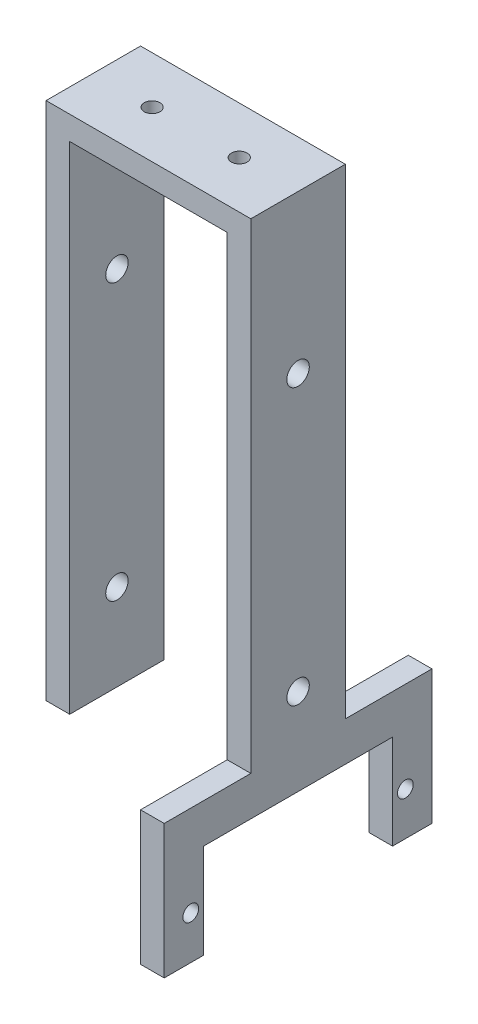
ISO-10303-21;
HEADER;
FILE_DESCRIPTION(('STEP AP214'),'2;1');
FILE_NAME('part.step','',(''),(''),'','','');
FILE_SCHEMA(('AUTOMOTIVE_DESIGN { 1 0 10303 214 1 1 1 1 }'));
ENDSEC;
DATA;
#1=APPLICATION_CONTEXT('core data for automotive mechanical design processes');
#2=APPLICATION_PROTOCOL_DEFINITION('international standard','automotive_design',2000,#1);
#3=PRODUCT_CONTEXT('',#1,'mechanical');
#4=PRODUCT('Part','Part','',(#3));
#5=PRODUCT_RELATED_PRODUCT_CATEGORY('part','',(#4));
#6=PRODUCT_DEFINITION_FORMATION('','',#4);
#7=PRODUCT_DEFINITION_CONTEXT('part definition',#1,'design');
#8=PRODUCT_DEFINITION('design','',#6,#7);
#9=PRODUCT_DEFINITION_SHAPE('','',#8);
#10=(LENGTH_UNIT() NAMED_UNIT(*) SI_UNIT(.MILLI.,.METRE.));
#11=(NAMED_UNIT(*) PLANE_ANGLE_UNIT() SI_UNIT($,.RADIAN.));
#12=(NAMED_UNIT(*) SI_UNIT($,.STERADIAN.) SOLID_ANGLE_UNIT());
#13=UNCERTAINTY_MEASURE_WITH_UNIT(LENGTH_MEASURE(1.E-05),#10,'distance_accuracy_value','');
#14=(GEOMETRIC_REPRESENTATION_CONTEXT(3) GLOBAL_UNCERTAINTY_ASSIGNED_CONTEXT((#13)) GLOBAL_UNIT_ASSIGNED_CONTEXT((#10,
#11,#12)) REPRESENTATION_CONTEXT('',''));
#15=CARTESIAN_POINT('',(0.,0.,0.));
#16=DIRECTION('',(0.,0.,1.));
#17=DIRECTION('',(1.,0.,0.));
#18=AXIS2_PLACEMENT_3D('',#15,#16,#17);
#19=CARTESIAN_POINT('',(-13.,3.,-6.));
#20=DIRECTION('',(0.,0.,1.));
#21=DIRECTION('',(1.,0.,0.));
#22=AXIS2_PLACEMENT_3D('',#19,#20,#21);
#23=PLANE('',#22);
#24=DIRECTION('',(0.,1.,0.));
#25=VECTOR('',#24,1.);
#26=CARTESIAN_POINT('',(-10.,-75.,-6.));
#27=LINE('',#26,#25);
#28=CARTESIAN_POINT('',(-10.,-63.,-6.));
#29=VERTEX_POINT('',#28);
#30=CARTESIAN_POINT('',(-10.,0.,-6.));
#31=VERTEX_POINT('',#30);
#32=EDGE_CURVE('E173',#29,#31,#27,.T.);
#33=ORIENTED_EDGE('',*,*,#32,.F.);
#34=DIRECTION('',(1.,0.,0.));
#35=VECTOR('',#34,1.);
#36=CARTESIAN_POINT('',(-13.,-63.,-6.));
#37=LINE('',#36,#35);
#38=CARTESIAN_POINT('',(-13.,-63.,-6.));
#39=VERTEX_POINT('',#38);
#40=EDGE_CURVE('E62',#39,#29,#37,.T.);
#41=ORIENTED_EDGE('',*,*,#40,.F.);
#42=DIRECTION('',(0.,-1.,0.));
#43=VECTOR('',#42,1.);
#44=CARTESIAN_POINT('',(-13.,3.,-6.));
#45=LINE('',#44,#43);
#46=CARTESIAN_POINT('',(-13.,3.,-6.));
#47=VERTEX_POINT('',#46);
#48=EDGE_CURVE('E54',#47,#39,#45,.T.);
#49=ORIENTED_EDGE('',*,*,#48,.F.);
#50=DIRECTION('',(-1.,0.,0.));
#51=VECTOR('',#50,1.);
#52=CARTESIAN_POINT('',(-13.,3.,-6.));
#53=LINE('',#52,#51);
#54=CARTESIAN_POINT('',(13.,3.,-6.));
#55=VERTEX_POINT('',#54);
#56=EDGE_CURVE('E232',#55,#47,#53,.T.);
#57=ORIENTED_EDGE('',*,*,#56,.F.);
#58=DIRECTION('',(0.,-1.,0.));
#59=VECTOR('',#58,1.);
#60=CARTESIAN_POINT('',(13.,3.,-6.));
#61=LINE('',#60,#59);
#62=CARTESIAN_POINT('',(13.,-58.,-6.));
#63=VERTEX_POINT('',#62);
#64=EDGE_CURVE('E13',#55,#63,#61,.T.);
#65=ORIENTED_EDGE('',*,*,#64,.T.);
#66=DIRECTION('',(1.,0.,0.));
#67=VECTOR('',#66,1.);
#68=CARTESIAN_POINT('',(9.99999999999999,-58.,-6.));
#69=LINE('',#68,#67);
#70=CARTESIAN_POINT('',(9.99999999999999,-58.,-6.));
#71=VERTEX_POINT('',#70);
#72=EDGE_CURVE('E328',#71,#63,#69,.T.);
#73=ORIENTED_EDGE('',*,*,#72,.F.);
#74=DIRECTION('',(0.,1.,0.));
#75=VECTOR('',#74,1.);
#76=CARTESIAN_POINT('',(10.,-75.,-6.));
#77=LINE('',#76,#75);
#78=CARTESIAN_POINT('',(10.,0.,-6.));
#79=VERTEX_POINT('',#78);
#80=EDGE_CURVE('E206',#71,#79,#77,.T.);
#81=ORIENTED_EDGE('',*,*,#80,.T.);
#82=DIRECTION('',(-1.,0.,0.));
#83=VECTOR('',#82,1.);
#84=CARTESIAN_POINT('',(-13.,0.,-6.));
#85=LINE('',#84,#83);
#86=EDGE_CURVE('E228',#79,#31,#85,.T.);
#87=ORIENTED_EDGE('',*,*,#86,.T.);
#88=EDGE_LOOP('',(#33,#41,#49,#57,#65,#73,#81,#87));
#89=FACE_BOUND('',#88,.T.);
#90=ADVANCED_FACE('F45',(#89),#23,.F.);
#91=CARTESIAN_POINT('',(13.,3.,6.));
#92=DIRECTION('',(-1.,0.,0.));
#93=DIRECTION('',(0.,0.,1.));
#94=AXIS2_PLACEMENT_3D('',#91,#92,#93);
#95=PLANE('',#94);
#96=CARTESIAN_POINT('',(13.,-69.5262873670848,-13.625));
#97=DIRECTION('',(-1.,0.,0.));
#98=DIRECTION('',(0.,0.,1.));
#99=AXIS2_PLACEMENT_3D('',#96,#97,#98);
#100=CIRCLE('',#99,1.);
#101=CARTESIAN_POINT('',(13.,-69.5262873670848,-12.625));
#102=VERTEX_POINT('',#101);
#103=EDGE_CURVE('E344',#102,#102,#100,.T.);
#104=ORIENTED_EDGE('',*,*,#103,.T.);
#105=EDGE_LOOP('',(#104));
#106=FACE_BOUND('',#105,.T.);
#107=CARTESIAN_POINT('',(13.,-69.5262873670848,13.625));
#108=DIRECTION('',(1.,0.,0.));
#109=DIRECTION('',(0.,0.,-1.));
#110=AXIS2_PLACEMENT_3D('',#107,#108,#109);
#111=CIRCLE('',#110,1.);
#112=CARTESIAN_POINT('',(13.,-69.5262873670848,12.625));
#113=VERTEX_POINT('',#112);
#114=EDGE_CURVE('E352',#113,#113,#111,.T.);
#115=ORIENTED_EDGE('',*,*,#114,.F.);
#116=EDGE_LOOP('',(#115));
#117=FACE_BOUND('',#116,.T.);
#118=CARTESIAN_POINT('',(13.,-52.,0.));
#119=DIRECTION('',(-1.,0.,0.));
#120=DIRECTION('',(0.,0.,1.));
#121=AXIS2_PLACEMENT_3D('',#118,#119,#120);
#122=CIRCLE('',#121,1.425);
#123=CARTESIAN_POINT('',(13.,-52.,1.425));
#124=VERTEX_POINT('',#123);
#125=EDGE_CURVE('E192',#124,#124,#122,.T.);
#126=ORIENTED_EDGE('',*,*,#125,.T.);
#127=EDGE_LOOP('',(#126));
#128=FACE_BOUND('',#127,.T.);
#129=CARTESIAN_POINT('',(13.,-17.,0.));
#130=DIRECTION('',(-1.,0.,0.));
#131=DIRECTION('',(0.,0.,1.));
#132=AXIS2_PLACEMENT_3D('',#129,#130,#131);
#133=CIRCLE('',#132,1.425);
#134=CARTESIAN_POINT('',(13.,-17.,1.425));
#135=VERTEX_POINT('',#134);
#136=EDGE_CURVE('E189',#135,#135,#133,.T.);
#137=ORIENTED_EDGE('',*,*,#136,.T.);
#138=EDGE_LOOP('',(#137));
#139=FACE_BOUND('',#138,.T.);
#140=DIRECTION('',(0.,0.,-1.));
#141=VECTOR('',#140,1.);
#142=CARTESIAN_POINT('',(13.,-63.,6.));
#143=LINE('',#142,#141);
#144=CARTESIAN_POINT('',(13.,-63.,12.));
#145=VERTEX_POINT('',#144);
#146=CARTESIAN_POINT('',(13.,-63.,-12.));
#147=VERTEX_POINT('',#146);
#148=EDGE_CURVE('E388',#145,#147,#143,.T.);
#149=ORIENTED_EDGE('',*,*,#148,.T.);
#150=DIRECTION('',(0.,1.,0.));
#151=VECTOR('',#150,1.);
#152=CARTESIAN_POINT('',(13.,-63.,-12.));
#153=LINE('',#152,#151);
#154=CARTESIAN_POINT('',(13.,-75.,-12.));
#155=VERTEX_POINT('',#154);
#156=EDGE_CURVE('E357',#155,#147,#153,.T.);
#157=ORIENTED_EDGE('',*,*,#156,.F.);
#158=DIRECTION('',(0.,0.,1.));
#159=VECTOR('',#158,1.);
#160=CARTESIAN_POINT('',(13.,-75.,-17.));
#161=LINE('',#160,#159);
#162=CARTESIAN_POINT('',(13.,-75.,-17.));
#163=VERTEX_POINT('',#162);
#164=EDGE_CURVE('E370',#163,#155,#161,.T.);
#165=ORIENTED_EDGE('',*,*,#164,.F.);
#166=DIRECTION('',(0.,-1.,0.));
#167=VECTOR('',#166,1.);
#168=CARTESIAN_POINT('',(13.,-58.,-17.));
#169=LINE('',#168,#167);
#170=CARTESIAN_POINT('',(13.,-58.,-17.));
#171=VERTEX_POINT('',#170);
#172=EDGE_CURVE('E372',#171,#163,#169,.T.);
#173=ORIENTED_EDGE('',*,*,#172,.F.);
#174=DIRECTION('',(0.,0.,-1.));
#175=VECTOR('',#174,1.);
#176=CARTESIAN_POINT('',(13.,-58.,-6.));
#177=LINE('',#176,#175);
#178=EDGE_CURVE('E325',#63,#171,#177,.T.);
#179=ORIENTED_EDGE('',*,*,#178,.F.);
#180=ORIENTED_EDGE('',*,*,#64,.F.);
#181=DIRECTION('',(0.,0.,-1.));
#182=VECTOR('',#181,1.);
#183=CARTESIAN_POINT('',(13.,3.,6.));
#184=LINE('',#183,#182);
#185=CARTESIAN_POINT('',(13.,3.,6.));
#186=VERTEX_POINT('',#185);
#187=EDGE_CURVE('E229',#186,#55,#184,.T.);
#188=ORIENTED_EDGE('',*,*,#187,.F.);
#189=DIRECTION('',(0.,-1.,0.));
#190=VECTOR('',#189,1.);
#191=CARTESIAN_POINT('',(13.,3.,6.));
#192=LINE('',#191,#190);
#193=CARTESIAN_POINT('',(13.,-58.,6.));
#194=VERTEX_POINT('',#193);
#195=EDGE_CURVE('E179',#186,#194,#192,.T.);
#196=ORIENTED_EDGE('',*,*,#195,.T.);
#197=DIRECTION('',(0.,0.,1.));
#198=VECTOR('',#197,1.);
#199=CARTESIAN_POINT('',(13.,-58.,6.));
#200=LINE('',#199,#198);
#201=CARTESIAN_POINT('',(13.,-58.,17.));
#202=VERTEX_POINT('',#201);
#203=EDGE_CURVE('E70',#194,#202,#200,.T.);
#204=ORIENTED_EDGE('',*,*,#203,.T.);
#205=DIRECTION('',(0.,-1.,0.));
#206=VECTOR('',#205,1.);
#207=CARTESIAN_POINT('',(13.,-63.,17.));
#208=LINE('',#207,#206);
#209=CARTESIAN_POINT('',(13.,-75.,17.));
#210=VERTEX_POINT('',#209);
#211=EDGE_CURVE('E396',#202,#210,#208,.T.);
#212=ORIENTED_EDGE('',*,*,#211,.T.);
#213=DIRECTION('',(0.,0.,-1.));
#214=VECTOR('',#213,1.);
#215=CARTESIAN_POINT('',(13.,-75.,17.));
#216=LINE('',#215,#214);
#217=CARTESIAN_POINT('',(13.,-75.,12.));
#218=VERTEX_POINT('',#217);
#219=EDGE_CURVE('E398',#210,#218,#216,.T.);
#220=ORIENTED_EDGE('',*,*,#219,.T.);
#221=DIRECTION('',(0.,1.,0.));
#222=VECTOR('',#221,1.);
#223=CARTESIAN_POINT('',(13.,-63.,12.));
#224=LINE('',#223,#222);
#225=EDGE_CURVE('E401',#218,#145,#224,.T.);
#226=ORIENTED_EDGE('',*,*,#225,.T.);
#227=EDGE_LOOP('',(#149,#157,#165,#173,#179,#180,#188,#196,#204,#212,#220,#226));
#228=FACE_BOUND('',#227,.T.);
#229=ADVANCED_FACE('F47',(#106,#117,#128,#139,#228),#95,.F.);
#230=CARTESIAN_POINT('',(-13.,3.,6.));
#231=DIRECTION('',(1.,0.,0.));
#232=DIRECTION('',(0.,0.,-1.));
#233=AXIS2_PLACEMENT_3D('',#230,#231,#232);
#234=PLANE('',#233);
#235=CARTESIAN_POINT('',(-13.,-52.,0.));
#236=DIRECTION('',(-1.,0.,0.));
#237=DIRECTION('',(0.,0.,1.));
#238=AXIS2_PLACEMENT_3D('',#235,#236,#237);
#239=CIRCLE('',#238,1.425);
#240=CARTESIAN_POINT('',(-13.,-52.,1.425));
#241=VERTEX_POINT('',#240);
#242=EDGE_CURVE('E262',#241,#241,#239,.T.);
#243=ORIENTED_EDGE('',*,*,#242,.F.);
#244=EDGE_LOOP('',(#243));
#245=FACE_BOUND('',#244,.T.);
#246=CARTESIAN_POINT('',(-13.,-17.,0.));
#247=DIRECTION('',(-1.,0.,0.));
#248=DIRECTION('',(0.,0.,1.));
#249=AXIS2_PLACEMENT_3D('',#246,#247,#248);
#250=CIRCLE('',#249,1.425);
#251=CARTESIAN_POINT('',(-13.,-17.,1.425));
#252=VERTEX_POINT('',#251);
#253=EDGE_CURVE('E185',#252,#252,#250,.T.);
#254=ORIENTED_EDGE('',*,*,#253,.F.);
#255=EDGE_LOOP('',(#254));
#256=FACE_BOUND('',#255,.T.);
#257=ORIENTED_EDGE('',*,*,#48,.T.);
#258=DIRECTION('',(0.,0.,1.));
#259=VECTOR('',#258,1.);
#260=CARTESIAN_POINT('',(-13.,-63.,-6.));
#261=LINE('',#260,#259);
#262=CARTESIAN_POINT('',(-13.,-63.,6.));
#263=VERTEX_POINT('',#262);
#264=EDGE_CURVE('E159',#39,#263,#261,.T.);
#265=ORIENTED_EDGE('',*,*,#264,.T.);
#266=DIRECTION('',(0.,-1.,0.));
#267=VECTOR('',#266,1.);
#268=CARTESIAN_POINT('',(-13.,3.,6.));
#269=LINE('',#268,#267);
#270=CARTESIAN_POINT('',(-13.,3.,6.));
#271=VERTEX_POINT('',#270);
#272=EDGE_CURVE('E177',#271,#263,#269,.T.);
#273=ORIENTED_EDGE('',*,*,#272,.F.);
#274=DIRECTION('',(0.,0.,1.));
#275=VECTOR('',#274,1.);
#276=CARTESIAN_POINT('',(-13.,3.,6.));
#277=LINE('',#276,#275);
#278=EDGE_CURVE('E176',#47,#271,#277,.T.);
#279=ORIENTED_EDGE('',*,*,#278,.F.);
#280=EDGE_LOOP('',(#257,#265,#273,#279));
#281=FACE_BOUND('',#280,.T.);
#282=ADVANCED_FACE('F175',(#245,#256,#281),#234,.F.);
#283=CARTESIAN_POINT('',(-13.,3.,6.));
#284=DIRECTION('',(0.,0.,-1.));
#285=DIRECTION('',(-1.,0.,0.));
#286=AXIS2_PLACEMENT_3D('',#283,#284,#285);
#287=PLANE('',#286);
#288=ORIENTED_EDGE('',*,*,#272,.T.);
#289=DIRECTION('',(1.,0.,0.));
#290=VECTOR('',#289,1.);
#291=CARTESIAN_POINT('',(-13.,-63.,6.));
#292=LINE('',#291,#290);
#293=CARTESIAN_POINT('',(-10.,-63.,6.));
#294=VERTEX_POINT('',#293);
#295=EDGE_CURVE('E162',#263,#294,#292,.T.);
#296=ORIENTED_EDGE('',*,*,#295,.T.);
#297=DIRECTION('',(0.,1.,0.));
#298=VECTOR('',#297,1.);
#299=CARTESIAN_POINT('',(-10.,-75.,6.));
#300=LINE('',#299,#298);
#301=CARTESIAN_POINT('',(-10.,0.,6.));
#302=VERTEX_POINT('',#301);
#303=EDGE_CURVE('E213',#294,#302,#300,.T.);
#304=ORIENTED_EDGE('',*,*,#303,.T.);
#305=DIRECTION('',(1.,0.,0.));
#306=VECTOR('',#305,1.);
#307=CARTESIAN_POINT('',(-13.,0.,6.));
#308=LINE('',#307,#306);
#309=CARTESIAN_POINT('',(10.,0.,6.));
#310=VERTEX_POINT('',#309);
#311=EDGE_CURVE('E233',#302,#310,#308,.T.);
#312=ORIENTED_EDGE('',*,*,#311,.T.);
#313=DIRECTION('',(0.,1.,0.));
#314=VECTOR('',#313,1.);
#315=CARTESIAN_POINT('',(10.,-75.,6.));
#316=LINE('',#315,#314);
#317=CARTESIAN_POINT('',(9.99999999999999,-58.,6.));
#318=VERTEX_POINT('',#317);
#319=EDGE_CURVE('E208',#318,#310,#316,.T.);
#320=ORIENTED_EDGE('',*,*,#319,.F.);
#321=DIRECTION('',(1.,0.,0.));
#322=VECTOR('',#321,1.);
#323=CARTESIAN_POINT('',(9.99999999999999,-58.,6.));
#324=LINE('',#323,#322);
#325=EDGE_CURVE('E250',#318,#194,#324,.T.);
#326=ORIENTED_EDGE('',*,*,#325,.T.);
#327=ORIENTED_EDGE('',*,*,#195,.F.);
#328=DIRECTION('',(1.,0.,0.));
#329=VECTOR('',#328,1.);
#330=CARTESIAN_POINT('',(-13.,3.,6.));
#331=LINE('',#330,#329);
#332=EDGE_CURVE('E236',#271,#186,#331,.T.);
#333=ORIENTED_EDGE('',*,*,#332,.F.);
#334=EDGE_LOOP('',(#288,#296,#304,#312,#320,#326,#327,#333));
#335=FACE_BOUND('',#334,.T.);
#336=ADVANCED_FACE('F248',(#335),#287,.F.);
#337=CARTESIAN_POINT('',(0.,3.,0.));
#338=DIRECTION('',(0.,-1.,0.));
#339=DIRECTION('',(0.,0.,-1.));
#340=AXIS2_PLACEMENT_3D('',#337,#338,#339);
#341=PLANE('',#340);
#342=CARTESIAN_POINT('',(-5.535,3.,0.));
#343=DIRECTION('',(0.,-1.,0.));
#344=DIRECTION('',(0.,0.,-1.));
#345=AXIS2_PLACEMENT_3D('',#342,#343,#344);
#346=CIRCLE('',#345,1.);
#347=CARTESIAN_POINT('',(-5.535,3.,-1.));
#348=VERTEX_POINT('',#347);
#349=EDGE_CURVE('E225',#348,#348,#346,.T.);
#350=ORIENTED_EDGE('',*,*,#349,.T.);
#351=EDGE_LOOP('',(#350));
#352=FACE_BOUND('',#351,.T.);
#353=CARTESIAN_POINT('',(5.535,3.,0.));
#354=DIRECTION('',(0.,-1.,0.));
#355=DIRECTION('',(0.,0.,-1.));
#356=AXIS2_PLACEMENT_3D('',#353,#354,#355);
#357=CIRCLE('',#356,1.);
#358=CARTESIAN_POINT('',(5.535,3.,-0.999999999999999));
#359=VERTEX_POINT('',#358);
#360=EDGE_CURVE('E220',#359,#359,#357,.T.);
#361=ORIENTED_EDGE('',*,*,#360,.T.);
#362=EDGE_LOOP('',(#361));
#363=FACE_BOUND('',#362,.T.);
#364=ORIENTED_EDGE('',*,*,#187,.T.);
#365=ORIENTED_EDGE('',*,*,#56,.T.);
#366=ORIENTED_EDGE('',*,*,#278,.T.);
#367=ORIENTED_EDGE('',*,*,#332,.T.);
#368=EDGE_LOOP('',(#364,#365,#366,#367));
#369=FACE_BOUND('',#368,.T.);
#370=ADVANCED_FACE('F302',(#352,#363,#369),#341,.F.);
#371=CARTESIAN_POINT('',(0.,0.,0.));
#372=DIRECTION('',(0.,-1.,0.));
#373=DIRECTION('',(0.,0.,-1.));
#374=AXIS2_PLACEMENT_3D('',#371,#372,#373);
#375=PLANE('',#374);
#376=DIRECTION('',(0.,0.,1.));
#377=VECTOR('',#376,1.);
#378=CARTESIAN_POINT('',(10.,0.,6.));
#379=LINE('',#378,#377);
#380=EDGE_CURVE('E203',#79,#310,#379,.T.);
#381=ORIENTED_EDGE('',*,*,#380,.T.);
#382=ORIENTED_EDGE('',*,*,#311,.F.);
#383=DIRECTION('',(0.,0.,1.));
#384=VECTOR('',#383,1.);
#385=CARTESIAN_POINT('',(-10.,0.,6.));
#386=LINE('',#385,#384);
#387=EDGE_CURVE('E210',#31,#302,#386,.T.);
#388=ORIENTED_EDGE('',*,*,#387,.F.);
#389=ORIENTED_EDGE('',*,*,#86,.F.);
#390=EDGE_LOOP('',(#381,#382,#388,#389));
#391=FACE_BOUND('',#390,.T.);
#392=CARTESIAN_POINT('',(-5.535,0.,0.));
#393=DIRECTION('',(0.,-1.,0.));
#394=DIRECTION('',(0.,0.,-1.));
#395=AXIS2_PLACEMENT_3D('',#392,#393,#394);
#396=CIRCLE('',#395,1.);
#397=CARTESIAN_POINT('',(-5.535,0.,-1.));
#398=VERTEX_POINT('',#397);
#399=EDGE_CURVE('E217',#398,#398,#396,.T.);
#400=ORIENTED_EDGE('',*,*,#399,.F.);
#401=EDGE_LOOP('',(#400));
#402=FACE_BOUND('',#401,.T.);
#403=CARTESIAN_POINT('',(5.535,0.,0.));
#404=DIRECTION('',(0.,-1.,0.));
#405=DIRECTION('',(0.,0.,-1.));
#406=AXIS2_PLACEMENT_3D('',#403,#404,#405);
#407=CIRCLE('',#406,1.);
#408=CARTESIAN_POINT('',(5.535,0.,-0.999999999999999));
#409=VERTEX_POINT('',#408);
#410=EDGE_CURVE('E216',#409,#409,#407,.T.);
#411=ORIENTED_EDGE('',*,*,#410,.F.);
#412=EDGE_LOOP('',(#411));
#413=FACE_BOUND('',#412,.T.);
#414=ADVANCED_FACE('F303',(#391,#402,#413),#375,.T.);
#415=CARTESIAN_POINT('',(5.535,10.,0.));
#416=DIRECTION('',(0.,-1.,0.));
#417=DIRECTION('',(0.,0.,-1.));
#418=AXIS2_PLACEMENT_3D('',#415,#416,#417);
#419=CYLINDRICAL_SURFACE('',#418,1.);
#420=ORIENTED_EDGE('',*,*,#410,.T.);
#421=EDGE_LOOP('',(#420));
#422=FACE_BOUND('',#421,.T.);
#423=ORIENTED_EDGE('',*,*,#360,.F.);
#424=EDGE_LOOP('',(#423));
#425=FACE_BOUND('',#424,.T.);
#426=ADVANCED_FACE('F306',(#422,#425),#419,.F.);
#427=CARTESIAN_POINT('',(-5.535,10.,0.));
#428=DIRECTION('',(0.,-1.,0.));
#429=DIRECTION('',(0.,0.,-1.));
#430=AXIS2_PLACEMENT_3D('',#427,#428,#429);
#431=CYLINDRICAL_SURFACE('',#430,1.);
#432=ORIENTED_EDGE('',*,*,#399,.T.);
#433=EDGE_LOOP('',(#432));
#434=FACE_BOUND('',#433,.T.);
#435=ORIENTED_EDGE('',*,*,#349,.F.);
#436=EDGE_LOOP('',(#435));
#437=FACE_BOUND('',#436,.T.);
#438=ADVANCED_FACE('F287',(#434,#437),#431,.F.);
#439=CARTESIAN_POINT('',(-10.,-75.,6.));
#440=DIRECTION('',(-1.,0.,0.));
#441=DIRECTION('',(0.,0.,1.));
#442=AXIS2_PLACEMENT_3D('',#439,#440,#441);
#443=PLANE('',#442);
#444=CARTESIAN_POINT('',(-10.,-52.,0.));
#445=DIRECTION('',(-1.,0.,0.));
#446=DIRECTION('',(0.,0.,1.));
#447=AXIS2_PLACEMENT_3D('',#444,#445,#446);
#448=CIRCLE('',#447,1.425);
#449=CARTESIAN_POINT('',(-10.,-52.,1.425));
#450=VERTEX_POINT('',#449);
#451=EDGE_CURVE('E197',#450,#450,#448,.T.);
#452=ORIENTED_EDGE('',*,*,#451,.T.);
#453=EDGE_LOOP('',(#452));
#454=FACE_BOUND('',#453,.T.);
#455=CARTESIAN_POINT('',(-10.,-17.,0.));
#456=DIRECTION('',(-1.,0.,0.));
#457=DIRECTION('',(0.,0.,1.));
#458=AXIS2_PLACEMENT_3D('',#455,#456,#457);
#459=CIRCLE('',#458,1.425);
#460=CARTESIAN_POINT('',(-10.,-17.,1.425));
#461=VERTEX_POINT('',#460);
#462=EDGE_CURVE('E184',#461,#461,#459,.T.);
#463=ORIENTED_EDGE('',*,*,#462,.T.);
#464=EDGE_LOOP('',(#463));
#465=FACE_BOUND('',#464,.T.);
#466=ORIENTED_EDGE('',*,*,#303,.F.);
#467=DIRECTION('',(0.,0.,-1.));
#468=VECTOR('',#467,1.);
#469=CARTESIAN_POINT('',(-10.,-63.,6.));
#470=LINE('',#469,#468);
#471=EDGE_CURVE('E343',#294,#29,#470,.T.);
#472=ORIENTED_EDGE('',*,*,#471,.T.);
#473=ORIENTED_EDGE('',*,*,#32,.T.);
#474=ORIENTED_EDGE('',*,*,#387,.T.);
#475=EDGE_LOOP('',(#466,#472,#473,#474));
#476=FACE_BOUND('',#475,.T.);
#477=ADVANCED_FACE('F278',(#454,#465,#476),#443,.F.);
#478=CARTESIAN_POINT('',(10.,-75.,6.));
#479=DIRECTION('',(-1.,0.,0.));
#480=DIRECTION('',(0.,0.,1.));
#481=AXIS2_PLACEMENT_3D('',#478,#479,#480);
#482=PLANE('',#481);
#483=DIRECTION('',(0.,1.,0.));
#484=VECTOR('',#483,1.);
#485=CARTESIAN_POINT('',(9.99999999999999,-63.,-12.));
#486=LINE('',#485,#484);
#487=CARTESIAN_POINT('',(9.99999999999999,-75.,-12.));
#488=VERTEX_POINT('',#487);
#489=CARTESIAN_POINT('',(9.99999999999999,-63.,-12.));
#490=VERTEX_POINT('',#489);
#491=EDGE_CURVE('E360',#488,#490,#486,.T.);
#492=ORIENTED_EDGE('',*,*,#491,.T.);
#493=DIRECTION('',(0.,0.,-1.));
#494=VECTOR('',#493,1.);
#495=CARTESIAN_POINT('',(9.99999999999999,-63.,6.));
#496=LINE('',#495,#494);
#497=CARTESIAN_POINT('',(9.99999999999999,-63.,12.));
#498=VERTEX_POINT('',#497);
#499=EDGE_CURVE('E254',#498,#490,#496,.T.);
#500=ORIENTED_EDGE('',*,*,#499,.F.);
#501=DIRECTION('',(0.,1.,0.));
#502=VECTOR('',#501,1.);
#503=CARTESIAN_POINT('',(9.99999999999999,-63.,12.));
#504=LINE('',#503,#502);
#505=CARTESIAN_POINT('',(9.99999999999999,-75.,12.));
#506=VERTEX_POINT('',#505);
#507=EDGE_CURVE('E258',#506,#498,#504,.T.);
#508=ORIENTED_EDGE('',*,*,#507,.F.);
#509=DIRECTION('',(0.,0.,-1.));
#510=VECTOR('',#509,1.);
#511=CARTESIAN_POINT('',(9.99999999999999,-75.,17.));
#512=LINE('',#511,#510);
#513=CARTESIAN_POINT('',(9.99999999999999,-75.,17.));
#514=VERTEX_POINT('',#513);
#515=EDGE_CURVE('E390',#514,#506,#512,.T.);
#516=ORIENTED_EDGE('',*,*,#515,.F.);
#517=DIRECTION('',(0.,-1.,0.));
#518=VECTOR('',#517,1.);
#519=CARTESIAN_POINT('',(9.99999999999999,-58.,17.));
#520=LINE('',#519,#518);
#521=CARTESIAN_POINT('',(9.99999999999999,-58.,17.));
#522=VERTEX_POINT('',#521);
#523=EDGE_CURVE('E387',#522,#514,#520,.T.);
#524=ORIENTED_EDGE('',*,*,#523,.F.);
#525=DIRECTION('',(0.,0.,1.));
#526=VECTOR('',#525,1.);
#527=CARTESIAN_POINT('',(9.99999999999999,-58.,6.));
#528=LINE('',#527,#526);
#529=EDGE_CURVE('E385',#318,#522,#528,.T.);
#530=ORIENTED_EDGE('',*,*,#529,.F.);
#531=ORIENTED_EDGE('',*,*,#319,.T.);
#532=ORIENTED_EDGE('',*,*,#380,.F.);
#533=ORIENTED_EDGE('',*,*,#80,.F.);
#534=DIRECTION('',(0.,0.,-1.));
#535=VECTOR('',#534,1.);
#536=CARTESIAN_POINT('',(9.99999999999999,-58.,-6.));
#537=LINE('',#536,#535);
#538=CARTESIAN_POINT('',(9.99999999999999,-58.,-17.));
#539=VERTEX_POINT('',#538);
#540=EDGE_CURVE('E335',#71,#539,#537,.T.);
#541=ORIENTED_EDGE('',*,*,#540,.T.);
#542=DIRECTION('',(0.,-1.,0.));
#543=VECTOR('',#542,1.);
#544=CARTESIAN_POINT('',(9.99999999999999,-63.,-17.));
#545=LINE('',#544,#543);
#546=CARTESIAN_POINT('',(9.99999999999999,-75.,-17.));
#547=VERTEX_POINT('',#546);
#548=EDGE_CURVE('E364',#539,#547,#545,.T.);
#549=ORIENTED_EDGE('',*,*,#548,.T.);
#550=DIRECTION('',(0.,0.,1.));
#551=VECTOR('',#550,1.);
#552=CARTESIAN_POINT('',(9.99999999999999,-75.,-17.));
#553=LINE('',#552,#551);
#554=EDGE_CURVE('E362',#547,#488,#553,.T.);
#555=ORIENTED_EDGE('',*,*,#554,.T.);
#556=EDGE_LOOP('',(#492,#500,#508,#516,#524,#530,#531,#532,#533,#541,#549,#555));
#557=FACE_BOUND('',#556,.T.);
#558=CARTESIAN_POINT('',(9.99999999999999,-69.5262873670848,-13.625));
#559=DIRECTION('',(-1.,0.,0.));
#560=DIRECTION('',(0.,0.,1.));
#561=AXIS2_PLACEMENT_3D('',#558,#559,#560);
#562=CIRCLE('',#561,1.);
#563=CARTESIAN_POINT('',(9.99999999999999,-69.5262873670848,-12.625));
#564=VERTEX_POINT('',#563);
#565=EDGE_CURVE('E347',#564,#564,#562,.T.);
#566=ORIENTED_EDGE('',*,*,#565,.F.);
#567=EDGE_LOOP('',(#566));
#568=FACE_BOUND('',#567,.T.);
#569=CARTESIAN_POINT('',(9.99999999999999,-69.5262873670848,13.625));
#570=DIRECTION('',(1.,0.,0.));
#571=DIRECTION('',(0.,0.,-1.));
#572=AXIS2_PLACEMENT_3D('',#569,#570,#571);
#573=CIRCLE('',#572,1.);
#574=CARTESIAN_POINT('',(9.99999999999999,-69.5262873670848,12.625));
#575=VERTEX_POINT('',#574);
#576=EDGE_CURVE('E354',#575,#575,#573,.T.);
#577=ORIENTED_EDGE('',*,*,#576,.T.);
#578=EDGE_LOOP('',(#577));
#579=FACE_BOUND('',#578,.T.);
#580=CARTESIAN_POINT('',(10.,-52.,0.));
#581=DIRECTION('',(-1.,0.,0.));
#582=DIRECTION('',(0.,0.,1.));
#583=AXIS2_PLACEMENT_3D('',#580,#581,#582);
#584=CIRCLE('',#583,1.425);
#585=CARTESIAN_POINT('',(10.,-52.,1.425));
#586=VERTEX_POINT('',#585);
#587=EDGE_CURVE('E49',#586,#586,#584,.T.);
#588=ORIENTED_EDGE('',*,*,#587,.F.);
#589=EDGE_LOOP('',(#588));
#590=FACE_BOUND('',#589,.T.);
#591=CARTESIAN_POINT('',(10.,-17.,0.));
#592=DIRECTION('',(-1.,0.,0.));
#593=DIRECTION('',(0.,0.,1.));
#594=AXIS2_PLACEMENT_3D('',#591,#592,#593);
#595=CIRCLE('',#594,1.425);
#596=CARTESIAN_POINT('',(10.,-17.,1.425));
#597=VERTEX_POINT('',#596);
#598=EDGE_CURVE('E182',#597,#597,#595,.T.);
#599=ORIENTED_EDGE('',*,*,#598,.F.);
#600=EDGE_LOOP('',(#599));
#601=FACE_BOUND('',#600,.T.);
#602=ADVANCED_FACE('F274',(#557,#568,#579,#590,#601),#482,.T.);
#603=CARTESIAN_POINT('',(17.,-17.,0.));
#604=DIRECTION('',(-1.,0.,0.));
#605=DIRECTION('',(0.,0.,1.));
#606=AXIS2_PLACEMENT_3D('',#603,#604,#605);
#607=CYLINDRICAL_SURFACE('',#606,1.425);
#608=ORIENTED_EDGE('',*,*,#598,.T.);
#609=EDGE_LOOP('',(#608));
#610=FACE_BOUND('',#609,.T.);
#611=ORIENTED_EDGE('',*,*,#136,.F.);
#612=EDGE_LOOP('',(#611));
#613=FACE_BOUND('',#612,.T.);
#614=ADVANCED_FACE('F277',(#610,#613),#607,.F.);
#615=ORIENTED_EDGE('',*,*,#253,.T.);
#616=EDGE_LOOP('',(#615));
#617=FACE_BOUND('',#616,.T.);
#618=ORIENTED_EDGE('',*,*,#462,.F.);
#619=EDGE_LOOP('',(#618));
#620=FACE_BOUND('',#619,.T.);
#621=ADVANCED_FACE('F285',(#617,#620),#607,.F.);
#622=CARTESIAN_POINT('',(17.,-52.,0.));
#623=DIRECTION('',(-1.,0.,0.));
#624=DIRECTION('',(0.,0.,1.));
#625=AXIS2_PLACEMENT_3D('',#622,#623,#624);
#626=CYLINDRICAL_SURFACE('',#625,1.425);
#627=ORIENTED_EDGE('',*,*,#587,.T.);
#628=EDGE_LOOP('',(#627));
#629=FACE_BOUND('',#628,.T.);
#630=ORIENTED_EDGE('',*,*,#125,.F.);
#631=EDGE_LOOP('',(#630));
#632=FACE_BOUND('',#631,.T.);
#633=ADVANCED_FACE('F271',(#629,#632),#626,.F.);
#634=ORIENTED_EDGE('',*,*,#242,.T.);
#635=EDGE_LOOP('',(#634));
#636=FACE_BOUND('',#635,.T.);
#637=ORIENTED_EDGE('',*,*,#451,.F.);
#638=EDGE_LOOP('',(#637));
#639=FACE_BOUND('',#638,.T.);
#640=ADVANCED_FACE('F455',(#636,#639),#626,.F.);
#641=CARTESIAN_POINT('',(9.99999999999999,-63.,6.));
#642=DIRECTION('',(0.,-1.,0.));
#643=DIRECTION('',(0.,0.,-1.));
#644=AXIS2_PLACEMENT_3D('',#641,#642,#643);
#645=PLANE('',#644);
#646=ORIENTED_EDGE('',*,*,#148,.F.);
#647=DIRECTION('',(1.,0.,0.));
#648=VECTOR('',#647,1.);
#649=CARTESIAN_POINT('',(9.99999999999999,-63.,12.));
#650=LINE('',#649,#648);
#651=EDGE_CURVE('E264',#498,#145,#650,.T.);
#652=ORIENTED_EDGE('',*,*,#651,.F.);
#653=ORIENTED_EDGE('',*,*,#499,.T.);
#654=DIRECTION('',(1.,0.,0.));
#655=VECTOR('',#654,1.);
#656=CARTESIAN_POINT('',(9.99999999999999,-63.,-12.));
#657=LINE('',#656,#655);
#658=EDGE_CURVE('E367',#490,#147,#657,.T.);
#659=ORIENTED_EDGE('',*,*,#658,.T.);
#660=EDGE_LOOP('',(#646,#652,#653,#659));
#661=FACE_BOUND('',#660,.T.);
#662=ADVANCED_FACE('F420',(#661),#645,.T.);
#663=CARTESIAN_POINT('',(9.99999999999999,-63.,12.));
#664=DIRECTION('',(0.,0.,-1.));
#665=DIRECTION('',(-1.,0.,0.));
#666=AXIS2_PLACEMENT_3D('',#663,#664,#665);
#667=PLANE('',#666);
#668=ORIENTED_EDGE('',*,*,#225,.F.);
#669=DIRECTION('',(1.,0.,0.));
#670=VECTOR('',#669,1.);
#671=CARTESIAN_POINT('',(9.99999999999999,-75.,12.));
#672=LINE('',#671,#670);
#673=EDGE_CURVE('E406',#506,#218,#672,.T.);
#674=ORIENTED_EDGE('',*,*,#673,.F.);
#675=ORIENTED_EDGE('',*,*,#507,.T.);
#676=ORIENTED_EDGE('',*,*,#651,.T.);
#677=EDGE_LOOP('',(#668,#674,#675,#676));
#678=FACE_BOUND('',#677,.T.);
#679=ADVANCED_FACE('F454',(#678),#667,.T.);
#680=CARTESIAN_POINT('',(9.99999999999999,-75.,17.));
#681=DIRECTION('',(0.,-1.,0.));
#682=DIRECTION('',(0.,0.,-1.));
#683=AXIS2_PLACEMENT_3D('',#680,#681,#682);
#684=PLANE('',#683);
#685=ORIENTED_EDGE('',*,*,#219,.F.);
#686=DIRECTION('',(1.,0.,0.));
#687=VECTOR('',#686,1.);
#688=CARTESIAN_POINT('',(9.99999999999999,-75.,17.));
#689=LINE('',#688,#687);
#690=EDGE_CURVE('E256',#514,#210,#689,.T.);
#691=ORIENTED_EDGE('',*,*,#690,.F.);
#692=ORIENTED_EDGE('',*,*,#515,.T.);
#693=ORIENTED_EDGE('',*,*,#673,.T.);
#694=EDGE_LOOP('',(#685,#691,#692,#693));
#695=FACE_BOUND('',#694,.T.);
#696=ADVANCED_FACE('F414',(#695),#684,.T.);
#697=CARTESIAN_POINT('',(9.99999999999999,-63.,17.));
#698=DIRECTION('',(0.,0.,1.));
#699=DIRECTION('',(0.,-1.,0.));
#700=AXIS2_PLACEMENT_3D('',#697,#698,#699);
#701=PLANE('',#700);
#702=ORIENTED_EDGE('',*,*,#211,.F.);
#703=DIRECTION('',(1.,0.,0.));
#704=VECTOR('',#703,1.);
#705=CARTESIAN_POINT('',(9.99999999999999,-58.,17.));
#706=LINE('',#705,#704);
#707=EDGE_CURVE('E253',#522,#202,#706,.T.);
#708=ORIENTED_EDGE('',*,*,#707,.F.);
#709=ORIENTED_EDGE('',*,*,#523,.T.);
#710=ORIENTED_EDGE('',*,*,#690,.T.);
#711=EDGE_LOOP('',(#702,#708,#709,#710));
#712=FACE_BOUND('',#711,.T.);
#713=ADVANCED_FACE('F410',(#712),#701,.T.);
#714=CARTESIAN_POINT('',(9.99999999999999,-58.,6.));
#715=DIRECTION('',(0.,1.,0.));
#716=DIRECTION('',(0.,0.,1.));
#717=AXIS2_PLACEMENT_3D('',#714,#715,#716);
#718=PLANE('',#717);
#719=ORIENTED_EDGE('',*,*,#203,.F.);
#720=ORIENTED_EDGE('',*,*,#325,.F.);
#721=ORIENTED_EDGE('',*,*,#529,.T.);
#722=ORIENTED_EDGE('',*,*,#707,.T.);
#723=EDGE_LOOP('',(#719,#720,#721,#722));
#724=FACE_BOUND('',#723,.T.);
#725=ADVANCED_FACE('F436',(#724),#718,.T.);
#726=CARTESIAN_POINT('',(9.99999999999999,-58.,-6.));
#727=DIRECTION('',(0.,-1.,0.));
#728=DIRECTION('',(0.,0.,-1.));
#729=AXIS2_PLACEMENT_3D('',#726,#727,#728);
#730=PLANE('',#729);
#731=ORIENTED_EDGE('',*,*,#178,.T.);
#732=DIRECTION('',(1.,0.,0.));
#733=VECTOR('',#732,1.);
#734=CARTESIAN_POINT('',(9.99999999999999,-58.,-17.));
#735=LINE('',#734,#733);
#736=EDGE_CURVE('E332',#539,#171,#735,.T.);
#737=ORIENTED_EDGE('',*,*,#736,.F.);
#738=ORIENTED_EDGE('',*,*,#540,.F.);
#739=ORIENTED_EDGE('',*,*,#72,.T.);
#740=EDGE_LOOP('',(#731,#737,#738,#739));
#741=FACE_BOUND('',#740,.T.);
#742=ADVANCED_FACE('F434',(#741),#730,.F.);
#743=CARTESIAN_POINT('',(9.99999999999999,-58.,-17.));
#744=DIRECTION('',(0.,0.,1.));
#745=DIRECTION('',(1.,0.,0.));
#746=AXIS2_PLACEMENT_3D('',#743,#744,#745);
#747=PLANE('',#746);
#748=ORIENTED_EDGE('',*,*,#172,.T.);
#749=DIRECTION('',(1.,0.,0.));
#750=VECTOR('',#749,1.);
#751=CARTESIAN_POINT('',(9.99999999999999,-75.,-17.));
#752=LINE('',#751,#750);
#753=EDGE_CURVE('E377',#547,#163,#752,.T.);
#754=ORIENTED_EDGE('',*,*,#753,.F.);
#755=ORIENTED_EDGE('',*,*,#548,.F.);
#756=ORIENTED_EDGE('',*,*,#736,.T.);
#757=EDGE_LOOP('',(#748,#754,#755,#756));
#758=FACE_BOUND('',#757,.T.);
#759=ADVANCED_FACE('F433',(#758),#747,.F.);
#760=CARTESIAN_POINT('',(9.99999999999999,-75.,-17.));
#761=DIRECTION('',(0.,1.,0.));
#762=DIRECTION('',(0.,0.,1.));
#763=AXIS2_PLACEMENT_3D('',#760,#761,#762);
#764=PLANE('',#763);
#765=ORIENTED_EDGE('',*,*,#164,.T.);
#766=DIRECTION('',(1.,0.,0.));
#767=VECTOR('',#766,1.);
#768=CARTESIAN_POINT('',(9.99999999999999,-75.,-12.));
#769=LINE('',#768,#767);
#770=EDGE_CURVE('E380',#488,#155,#769,.T.);
#771=ORIENTED_EDGE('',*,*,#770,.F.);
#772=ORIENTED_EDGE('',*,*,#554,.F.);
#773=ORIENTED_EDGE('',*,*,#753,.T.);
#774=EDGE_LOOP('',(#765,#771,#772,#773));
#775=FACE_BOUND('',#774,.T.);
#776=ADVANCED_FACE('F429',(#775),#764,.F.);
#777=CARTESIAN_POINT('',(9.99999999999999,-63.,-12.));
#778=DIRECTION('',(0.,0.,-1.));
#779=DIRECTION('',(-1.,0.,0.));
#780=AXIS2_PLACEMENT_3D('',#777,#778,#779);
#781=PLANE('',#780);
#782=ORIENTED_EDGE('',*,*,#156,.T.);
#783=ORIENTED_EDGE('',*,*,#658,.F.);
#784=ORIENTED_EDGE('',*,*,#491,.F.);
#785=ORIENTED_EDGE('',*,*,#770,.T.);
#786=EDGE_LOOP('',(#782,#783,#784,#785));
#787=FACE_BOUND('',#786,.T.);
#788=ADVANCED_FACE('F425',(#787),#781,.F.);
#789=CARTESIAN_POINT('',(9.99999999999999,-69.5262873670848,13.625));
#790=DIRECTION('',(1.,0.,0.));
#791=DIRECTION('',(0.,0.,-1.));
#792=AXIS2_PLACEMENT_3D('',#789,#790,#791);
#793=CYLINDRICAL_SURFACE('',#792,1.);
#794=ORIENTED_EDGE('',*,*,#576,.F.);
#795=EDGE_LOOP('',(#794));
#796=FACE_BOUND('',#795,.T.);
#797=ORIENTED_EDGE('',*,*,#114,.T.);
#798=EDGE_LOOP('',(#797));
#799=FACE_BOUND('',#798,.T.);
#800=ADVANCED_FACE('F445',(#796,#799),#793,.F.);
#801=CARTESIAN_POINT('',(9.99999999999999,-69.5262873670848,-13.625));
#802=DIRECTION('',(1.,0.,0.));
#803=DIRECTION('',(0.,0.,-1.));
#804=AXIS2_PLACEMENT_3D('',#801,#802,#803);
#805=CYLINDRICAL_SURFACE('',#804,1.);
#806=ORIENTED_EDGE('',*,*,#565,.T.);
#807=EDGE_LOOP('',(#806));
#808=FACE_BOUND('',#807,.T.);
#809=ORIENTED_EDGE('',*,*,#103,.F.);
#810=EDGE_LOOP('',(#809));
#811=FACE_BOUND('',#810,.T.);
#812=ADVANCED_FACE('F528',(#808,#811),#805,.F.);
#813=CARTESIAN_POINT('',(-13.,-63.,-6.));
#814=DIRECTION('',(0.,1.,0.));
#815=DIRECTION('',(0.,0.,1.));
#816=AXIS2_PLACEMENT_3D('',#813,#814,#815);
#817=PLANE('',#816);
#818=ORIENTED_EDGE('',*,*,#295,.F.);
#819=ORIENTED_EDGE('',*,*,#264,.F.);
#820=ORIENTED_EDGE('',*,*,#40,.T.);
#821=ORIENTED_EDGE('',*,*,#471,.F.);
#822=EDGE_LOOP('',(#818,#819,#820,#821));
#823=FACE_BOUND('',#822,.T.);
#824=ADVANCED_FACE('F160',(#823),#817,.F.);
#825=CLOSED_SHELL('',(#90,#229,#282,#336,#370,#414,#426,#438,#477,#602,#614,#621,#633,#640,#662,
#679,#696,#713,#725,#742,#759,#776,#788,#800,#812,#824));
#826=MANIFOLD_SOLID_BREP('B2',#825);
#827=ADVANCED_BREP_SHAPE_REPRESENTATION('',(#18,#826),#14);
#828=SHAPE_DEFINITION_REPRESENTATION(#9,#827);
ENDSEC;
END-ISO-10303-21;
